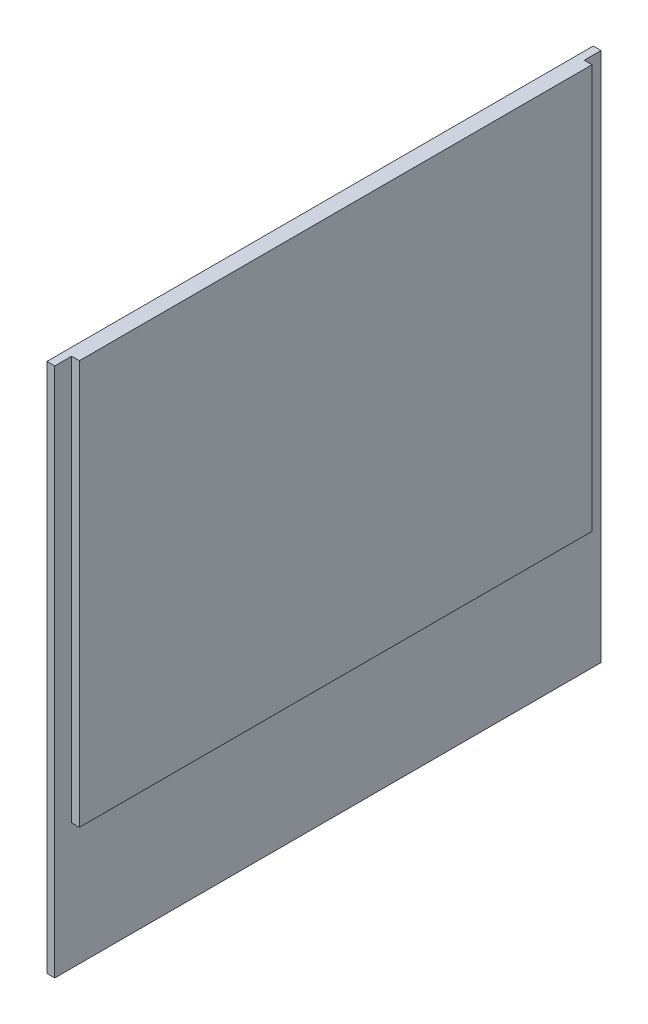
ISO-10303-21;
HEADER;
FILE_DESCRIPTION(('STEP AP214'),'2;1');
FILE_NAME('part.step','',(''),(''),'','','');
FILE_SCHEMA(('AUTOMOTIVE_DESIGN { 1 0 10303 214 1 1 1 1 }'));
ENDSEC;
DATA;
#1=APPLICATION_CONTEXT('core data for automotive mechanical design processes');
#2=APPLICATION_PROTOCOL_DEFINITION('international standard','automotive_design',2000,#1);
#3=PRODUCT_CONTEXT('',#1,'mechanical');
#4=PRODUCT('Part','Part','',(#3));
#5=PRODUCT_RELATED_PRODUCT_CATEGORY('part','',(#4));
#6=PRODUCT_DEFINITION_FORMATION('','',#4);
#7=PRODUCT_DEFINITION_CONTEXT('part definition',#1,'design');
#8=PRODUCT_DEFINITION('design','',#6,#7);
#9=PRODUCT_DEFINITION_SHAPE('','',#8);
#10=(LENGTH_UNIT() NAMED_UNIT(*) SI_UNIT(.MILLI.,.METRE.));
#11=(NAMED_UNIT(*) PLANE_ANGLE_UNIT() SI_UNIT($,.RADIAN.));
#12=(NAMED_UNIT(*) SI_UNIT($,.STERADIAN.) SOLID_ANGLE_UNIT());
#13=UNCERTAINTY_MEASURE_WITH_UNIT(LENGTH_MEASURE(1.E-05),#10,'distance_accuracy_value','');
#14=(GEOMETRIC_REPRESENTATION_CONTEXT(3) GLOBAL_UNCERTAINTY_ASSIGNED_CONTEXT((#13)) GLOBAL_UNIT_ASSIGNED_CONTEXT((#10,
#11,#12)) REPRESENTATION_CONTEXT('',''));
#15=CARTESIAN_POINT('',(0.,0.,0.));
#16=DIRECTION('',(0.,0.,1.));
#17=DIRECTION('',(1.,0.,0.));
#18=AXIS2_PLACEMENT_3D('',#15,#16,#17);
#19=CARTESIAN_POINT('',(1.5875,0.,0.));
#20=DIRECTION('',(-1.,0.,0.));
#21=DIRECTION('',(0.,0.,1.));
#22=AXIS2_PLACEMENT_3D('',#19,#20,#21);
#23=PLANE('',#22);
#24=DIRECTION('',(0.,-1.,0.));
#25=VECTOR('',#24,1.);
#26=CARTESIAN_POINT('',(1.5875,107.95,-3.429));
#27=LINE('',#26,#25);
#28=CARTESIAN_POINT('',(1.5875,107.95,-3.429));
#29=VERTEX_POINT('',#28);
#30=CARTESIAN_POINT('',(1.5875,25.654,-3.42900000000001));
#31=VERTEX_POINT('',#30);
#32=EDGE_CURVE('E64',#29,#31,#27,.T.);
#33=ORIENTED_EDGE('',*,*,#32,.F.);
#34=DIRECTION('',(0.,0.,1.));
#35=VECTOR('',#34,1.);
#36=CARTESIAN_POINT('',(1.5875,107.95,0.));
#37=LINE('',#36,#35);
#38=CARTESIAN_POINT('',(1.5875,107.95,0.));
#39=VERTEX_POINT('',#38);
#40=EDGE_CURVE('E154',#29,#39,#37,.T.);
#41=ORIENTED_EDGE('',*,*,#40,.T.);
#42=DIRECTION('',(0.,-1.,0.));
#43=VECTOR('',#42,1.);
#44=CARTESIAN_POINT('',(1.5875,0.,0.));
#45=LINE('',#44,#43);
#46=CARTESIAN_POINT('',(1.5875,0.,0.));
#47=VERTEX_POINT('',#46);
#48=EDGE_CURVE('E143',#39,#47,#45,.T.);
#49=ORIENTED_EDGE('',*,*,#48,.T.);
#50=DIRECTION('',(0.,0.,-1.));
#51=VECTOR('',#50,1.);
#52=CARTESIAN_POINT('',(1.5875,0.,0.));
#53=LINE('',#52,#51);
#54=CARTESIAN_POINT('',(1.5875,0.,-111.252));
#55=VERTEX_POINT('',#54);
#56=EDGE_CURVE('E147',#47,#55,#53,.T.);
#57=ORIENTED_EDGE('',*,*,#56,.T.);
#58=DIRECTION('',(0.,1.,0.));
#59=VECTOR('',#58,1.);
#60=CARTESIAN_POINT('',(1.5875,0.,-111.252));
#61=LINE('',#60,#59);
#62=CARTESIAN_POINT('',(1.5875,107.95,-111.252));
#63=VERTEX_POINT('',#62);
#64=EDGE_CURVE('E151',#55,#63,#61,.T.);
#65=ORIENTED_EDGE('',*,*,#64,.T.);
#66=CARTESIAN_POINT('',(1.5875,107.95,-107.823));
#67=VERTEX_POINT('',#66);
#68=EDGE_CURVE('E155',#63,#67,#37,.T.);
#69=ORIENTED_EDGE('',*,*,#68,.T.);
#70=DIRECTION('',(0.,1.,0.));
#71=VECTOR('',#70,1.);
#72=CARTESIAN_POINT('',(1.5875,107.95,-107.823));
#73=LINE('',#72,#71);
#74=CARTESIAN_POINT('',(1.5875,25.654,-107.823));
#75=VERTEX_POINT('',#74);
#76=EDGE_CURVE('E128',#75,#67,#73,.T.);
#77=ORIENTED_EDGE('',*,*,#76,.F.);
#78=DIRECTION('',(0.,0.,-1.));
#79=VECTOR('',#78,1.);
#80=CARTESIAN_POINT('',(1.5875,25.654,-3.42900000000001));
#81=LINE('',#80,#79);
#82=EDGE_CURVE('E59',#31,#75,#81,.T.);
#83=ORIENTED_EDGE('',*,*,#82,.F.);
#84=EDGE_LOOP('',(#33,#41,#49,#57,#65,#69,#77,#83));
#85=FACE_BOUND('',#84,.T.);
#86=ADVANCED_FACE('F43',(#85),#23,.F.);
#87=CARTESIAN_POINT('',(1.5875,0.,0.));
#88=DIRECTION('',(0.,0.,-1.));
#89=DIRECTION('',(-1.,0.,0.));
#90=AXIS2_PLACEMENT_3D('',#87,#88,#89);
#91=PLANE('',#90);
#92=DIRECTION('',(0.,-1.,0.));
#93=VECTOR('',#92,1.);
#94=CARTESIAN_POINT('',(0.,0.,0.));
#95=LINE('',#94,#93);
#96=CARTESIAN_POINT('',(0.,107.95,0.));
#97=VERTEX_POINT('',#96);
#98=CARTESIAN_POINT('',(0.,0.,0.));
#99=VERTEX_POINT('',#98);
#100=EDGE_CURVE('E132',#97,#99,#95,.T.);
#101=ORIENTED_EDGE('',*,*,#100,.T.);
#102=DIRECTION('',(-1.,0.,0.));
#103=VECTOR('',#102,1.);
#104=CARTESIAN_POINT('',(1.5875,0.,0.));
#105=LINE('',#104,#103);
#106=EDGE_CURVE('E11',#47,#99,#105,.T.);
#107=ORIENTED_EDGE('',*,*,#106,.F.);
#108=ORIENTED_EDGE('',*,*,#48,.F.);
#109=DIRECTION('',(-1.,0.,0.));
#110=VECTOR('',#109,1.);
#111=CARTESIAN_POINT('',(1.5875,107.95,0.));
#112=LINE('',#111,#110);
#113=EDGE_CURVE('E157',#39,#97,#112,.T.);
#114=ORIENTED_EDGE('',*,*,#113,.T.);
#115=EDGE_LOOP('',(#101,#107,#108,#114));
#116=FACE_BOUND('',#115,.T.);
#117=ADVANCED_FACE('F45',(#116),#91,.F.);
#118=CARTESIAN_POINT('',(1.5875,0.,0.));
#119=DIRECTION('',(0.,1.,0.));
#120=DIRECTION('',(0.,0.,1.));
#121=AXIS2_PLACEMENT_3D('',#118,#119,#120);
#122=PLANE('',#121);
#123=DIRECTION('',(0.,0.,-1.));
#124=VECTOR('',#123,1.);
#125=CARTESIAN_POINT('',(0.,0.,0.));
#126=LINE('',#125,#124);
#127=CARTESIAN_POINT('',(0.,0.,-111.252));
#128=VERTEX_POINT('',#127);
#129=EDGE_CURVE('E137',#99,#128,#126,.T.);
#130=ORIENTED_EDGE('',*,*,#129,.T.);
#131=DIRECTION('',(-1.,0.,0.));
#132=VECTOR('',#131,1.);
#133=CARTESIAN_POINT('',(1.5875,0.,-111.252));
#134=LINE('',#133,#132);
#135=EDGE_CURVE('E52',#55,#128,#134,.T.);
#136=ORIENTED_EDGE('',*,*,#135,.F.);
#137=ORIENTED_EDGE('',*,*,#56,.F.);
#138=ORIENTED_EDGE('',*,*,#106,.T.);
#139=EDGE_LOOP('',(#130,#136,#137,#138));
#140=FACE_BOUND('',#139,.T.);
#141=ADVANCED_FACE('F225',(#140),#122,.F.);
#142=CARTESIAN_POINT('',(1.5875,0.,-111.252));
#143=DIRECTION('',(0.,0.,1.));
#144=DIRECTION('',(1.,0.,0.));
#145=AXIS2_PLACEMENT_3D('',#142,#143,#144);
#146=PLANE('',#145);
#147=DIRECTION('',(0.,1.,0.));
#148=VECTOR('',#147,1.);
#149=CARTESIAN_POINT('',(0.,0.,-111.252));
#150=LINE('',#149,#148);
#151=CARTESIAN_POINT('',(0.,107.95,-111.252));
#152=VERTEX_POINT('',#151);
#153=EDGE_CURVE('E161',#128,#152,#150,.T.);
#154=ORIENTED_EDGE('',*,*,#153,.T.);
#155=DIRECTION('',(-1.,0.,0.));
#156=VECTOR('',#155,1.);
#157=CARTESIAN_POINT('',(1.5875,107.95,-111.252));
#158=LINE('',#157,#156);
#159=EDGE_CURVE('E169',#63,#152,#158,.T.);
#160=ORIENTED_EDGE('',*,*,#159,.F.);
#161=ORIENTED_EDGE('',*,*,#64,.F.);
#162=ORIENTED_EDGE('',*,*,#135,.T.);
#163=EDGE_LOOP('',(#154,#160,#161,#162));
#164=FACE_BOUND('',#163,.T.);
#165=ADVANCED_FACE('F178',(#164),#146,.F.);
#166=CARTESIAN_POINT('',(1.5875,107.95,0.));
#167=DIRECTION('',(0.,-1.,0.));
#168=DIRECTION('',(0.,0.,-1.));
#169=AXIS2_PLACEMENT_3D('',#166,#167,#168);
#170=PLANE('',#169);
#171=DIRECTION('',(0.,0.,1.));
#172=VECTOR('',#171,1.);
#173=CARTESIAN_POINT('',(0.,107.95,0.));
#174=LINE('',#173,#172);
#175=EDGE_CURVE('E148',#152,#97,#174,.T.);
#176=ORIENTED_EDGE('',*,*,#175,.T.);
#177=ORIENTED_EDGE('',*,*,#113,.F.);
#178=ORIENTED_EDGE('',*,*,#40,.F.);
#179=DIRECTION('',(-1.,0.,0.));
#180=VECTOR('',#179,1.);
#181=CARTESIAN_POINT('',(3.175,107.95,-3.429));
#182=LINE('',#181,#180);
#183=CARTESIAN_POINT('',(3.175,107.95,-3.429));
#184=VERTEX_POINT('',#183);
#185=EDGE_CURVE('E193',#184,#29,#182,.T.);
#186=ORIENTED_EDGE('',*,*,#185,.F.);
#187=DIRECTION('',(0.,0.,1.));
#188=VECTOR('',#187,1.);
#189=CARTESIAN_POINT('',(3.175,107.95,-3.429));
#190=LINE('',#189,#188);
#191=CARTESIAN_POINT('',(3.175,107.95,-107.823));
#192=VERTEX_POINT('',#191);
#193=EDGE_CURVE('E123',#192,#184,#190,.T.);
#194=ORIENTED_EDGE('',*,*,#193,.F.);
#195=DIRECTION('',(-1.,0.,0.));
#196=VECTOR('',#195,1.);
#197=CARTESIAN_POINT('',(3.175,107.95,-107.823));
#198=LINE('',#197,#196);
#199=EDGE_CURVE('E139',#192,#67,#198,.T.);
#200=ORIENTED_EDGE('',*,*,#199,.T.);
#201=ORIENTED_EDGE('',*,*,#68,.F.);
#202=ORIENTED_EDGE('',*,*,#159,.T.);
#203=EDGE_LOOP('',(#176,#177,#178,#186,#194,#200,#201,#202));
#204=FACE_BOUND('',#203,.T.);
#205=ADVANCED_FACE('F187',(#204),#170,.F.);
#206=CARTESIAN_POINT('',(0.,0.,0.));
#207=DIRECTION('',(-1.,0.,0.));
#208=DIRECTION('',(0.,0.,1.));
#209=AXIS2_PLACEMENT_3D('',#206,#207,#208);
#210=PLANE('',#209);
#211=ORIENTED_EDGE('',*,*,#100,.F.);
#212=ORIENTED_EDGE('',*,*,#175,.F.);
#213=ORIENTED_EDGE('',*,*,#153,.F.);
#214=ORIENTED_EDGE('',*,*,#129,.F.);
#215=EDGE_LOOP('',(#211,#212,#213,#214));
#216=FACE_BOUND('',#215,.T.);
#217=ADVANCED_FACE('F184',(#216),#210,.T.);
#218=CARTESIAN_POINT('',(3.175,107.95,-3.429));
#219=DIRECTION('',(0.,0.,-1.));
#220=DIRECTION('',(0.,1.,0.));
#221=AXIS2_PLACEMENT_3D('',#218,#219,#220);
#222=PLANE('',#221);
#223=ORIENTED_EDGE('',*,*,#32,.T.);
#224=DIRECTION('',(-1.,0.,0.));
#225=VECTOR('',#224,1.);
#226=CARTESIAN_POINT('',(3.175,25.654,-3.42900000000001));
#227=LINE('',#226,#225);
#228=CARTESIAN_POINT('',(3.175,25.654,-3.42900000000001));
#229=VERTEX_POINT('',#228);
#230=EDGE_CURVE('E111',#229,#31,#227,.T.);
#231=ORIENTED_EDGE('',*,*,#230,.F.);
#232=DIRECTION('',(0.,-1.,0.));
#233=VECTOR('',#232,1.);
#234=CARTESIAN_POINT('',(3.175,107.95,-3.429));
#235=LINE('',#234,#233);
#236=EDGE_CURVE('E118',#184,#229,#235,.T.);
#237=ORIENTED_EDGE('',*,*,#236,.F.);
#238=ORIENTED_EDGE('',*,*,#185,.T.);
#239=EDGE_LOOP('',(#223,#231,#237,#238));
#240=FACE_BOUND('',#239,.T.);
#241=ADVANCED_FACE('F130',(#240),#222,.F.);
#242=CARTESIAN_POINT('',(3.175,25.654,-3.42900000000001));
#243=DIRECTION('',(0.,1.,0.));
#244=DIRECTION('',(0.,0.,1.));
#245=AXIS2_PLACEMENT_3D('',#242,#243,#244);
#246=PLANE('',#245);
#247=ORIENTED_EDGE('',*,*,#82,.T.);
#248=DIRECTION('',(-1.,0.,0.));
#249=VECTOR('',#248,1.);
#250=CARTESIAN_POINT('',(3.175,25.654,-107.823));
#251=LINE('',#250,#249);
#252=CARTESIAN_POINT('',(3.175,25.654,-107.823));
#253=VERTEX_POINT('',#252);
#254=EDGE_CURVE('E113',#253,#75,#251,.T.);
#255=ORIENTED_EDGE('',*,*,#254,.F.);
#256=DIRECTION('',(0.,0.,-1.));
#257=VECTOR('',#256,1.);
#258=CARTESIAN_POINT('',(3.175,25.654,-3.42900000000001));
#259=LINE('',#258,#257);
#260=EDGE_CURVE('E107',#229,#253,#259,.T.);
#261=ORIENTED_EDGE('',*,*,#260,.F.);
#262=ORIENTED_EDGE('',*,*,#230,.T.);
#263=EDGE_LOOP('',(#247,#255,#261,#262));
#264=FACE_BOUND('',#263,.T.);
#265=ADVANCED_FACE('F109',(#264),#246,.F.);
#266=CARTESIAN_POINT('',(3.175,107.95,-107.823));
#267=DIRECTION('',(0.,0.,1.));
#268=DIRECTION('',(0.,-1.,0.));
#269=AXIS2_PLACEMENT_3D('',#266,#267,#268);
#270=PLANE('',#269);
#271=ORIENTED_EDGE('',*,*,#76,.T.);
#272=ORIENTED_EDGE('',*,*,#199,.F.);
#273=DIRECTION('',(0.,1.,0.));
#274=VECTOR('',#273,1.);
#275=CARTESIAN_POINT('',(3.175,107.95,-107.823));
#276=LINE('',#275,#274);
#277=EDGE_CURVE('E117',#253,#192,#276,.T.);
#278=ORIENTED_EDGE('',*,*,#277,.F.);
#279=ORIENTED_EDGE('',*,*,#254,.T.);
#280=EDGE_LOOP('',(#271,#272,#278,#279));
#281=FACE_BOUND('',#280,.T.);
#282=ADVANCED_FACE('F211',(#281),#270,.F.);
#283=CARTESIAN_POINT('',(3.175,0.,0.));
#284=DIRECTION('',(1.,0.,0.));
#285=DIRECTION('',(0.,0.,-1.));
#286=AXIS2_PLACEMENT_3D('',#283,#284,#285);
#287=PLANE('',#286);
#288=ORIENTED_EDGE('',*,*,#236,.T.);
#289=ORIENTED_EDGE('',*,*,#260,.T.);
#290=ORIENTED_EDGE('',*,*,#277,.T.);
#291=ORIENTED_EDGE('',*,*,#193,.T.);
#292=EDGE_LOOP('',(#288,#289,#290,#291));
#293=FACE_BOUND('',#292,.T.);
#294=ADVANCED_FACE('F121',(#293),#287,.T.);
#295=CLOSED_SHELL('',(#86,#117,#141,#165,#205,#217,#241,#265,#282,#294));
#296=MANIFOLD_SOLID_BREP('B2',#295);
#297=ADVANCED_BREP_SHAPE_REPRESENTATION('',(#18,#296),#14);
#298=SHAPE_DEFINITION_REPRESENTATION(#9,#297);
ENDSEC;
END-ISO-10303-21;
